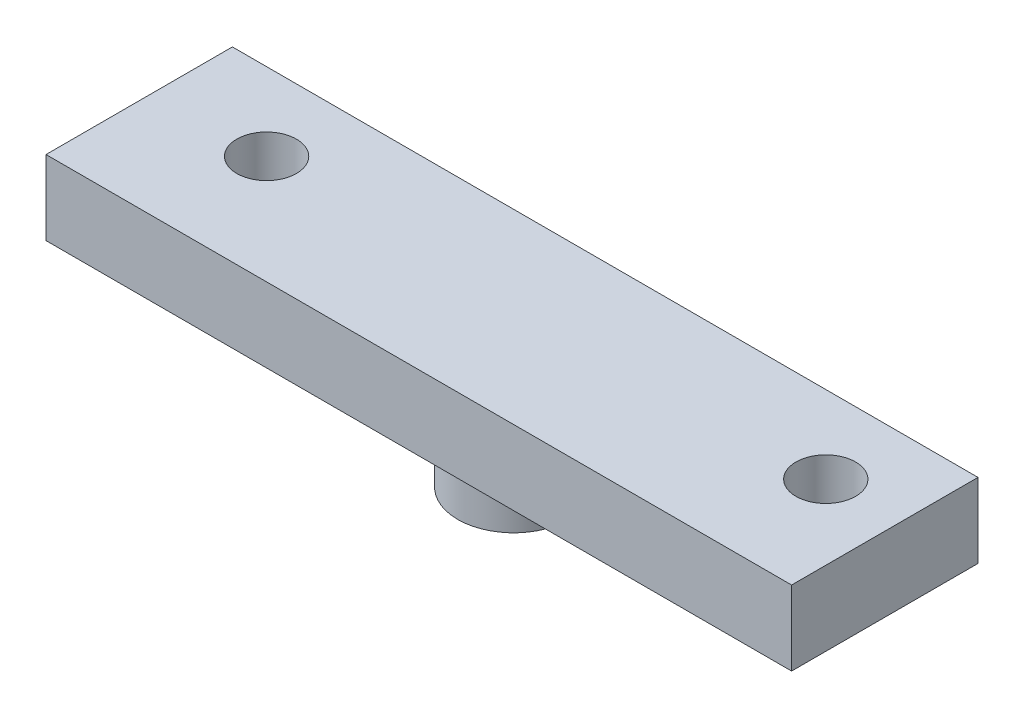
ISO-10303-21;
HEADER;
FILE_DESCRIPTION(('STEP AP214'),'2;1');
FILE_NAME('part.step','',(''),(''),'','','');
FILE_SCHEMA(('AUTOMOTIVE_DESIGN { 1 0 10303 214 1 1 1 1 }'));
ENDSEC;
DATA;
#1=APPLICATION_CONTEXT('core data for automotive mechanical design processes');
#2=APPLICATION_PROTOCOL_DEFINITION('international standard','automotive_design',2000,#1);
#3=PRODUCT_CONTEXT('',#1,'mechanical');
#4=PRODUCT('Part','Part','',(#3));
#5=PRODUCT_RELATED_PRODUCT_CATEGORY('part','',(#4));
#6=PRODUCT_DEFINITION_FORMATION('','',#4);
#7=PRODUCT_DEFINITION_CONTEXT('part definition',#1,'design');
#8=PRODUCT_DEFINITION('design','',#6,#7);
#9=PRODUCT_DEFINITION_SHAPE('','',#8);
#10=(LENGTH_UNIT() NAMED_UNIT(*) SI_UNIT(.MILLI.,.METRE.));
#11=(NAMED_UNIT(*) PLANE_ANGLE_UNIT() SI_UNIT($,.RADIAN.));
#12=(NAMED_UNIT(*) SI_UNIT($,.STERADIAN.) SOLID_ANGLE_UNIT());
#13=UNCERTAINTY_MEASURE_WITH_UNIT(LENGTH_MEASURE(1.E-05),#10,'distance_accuracy_value','');
#14=(GEOMETRIC_REPRESENTATION_CONTEXT(3) GLOBAL_UNCERTAINTY_ASSIGNED_CONTEXT((#13)) GLOBAL_UNIT_ASSIGNED_CONTEXT((#10,
#11,#12)) REPRESENTATION_CONTEXT('',''));
#15=CARTESIAN_POINT('',(0.,0.,0.));
#16=DIRECTION('',(0.,0.,1.));
#17=DIRECTION('',(1.,0.,0.));
#18=AXIS2_PLACEMENT_3D('',#15,#16,#17);
#19=CARTESIAN_POINT('',(0.,2.,0.));
#20=DIRECTION('',(0.,1.,0.));
#21=DIRECTION('',(0.,0.,1.));
#22=AXIS2_PLACEMENT_3D('',#19,#20,#21);
#23=PLANE('',#22);
#24=CARTESIAN_POINT('',(2.67762937928907,2.,-1.37738689699063));
#25=DIRECTION('',(0.,1.,0.));
#26=DIRECTION('',(0.,0.,1.));
#27=AXIS2_PLACEMENT_3D('',#24,#25,#26);
#28=CIRCLE('',#27,0.800000000000001);
#29=CARTESIAN_POINT('',(2.67762937928907,2.,-0.577386896990629));
#30=VERTEX_POINT('',#29);
#31=EDGE_CURVE('E132',#30,#30,#28,.T.);
#32=ORIENTED_EDGE('',*,*,#31,.F.);
#33=EDGE_LOOP('',(#32));
#34=FACE_BOUND('',#33,.T.);
#35=DIRECTION('',(0.,0.,1.));
#36=VECTOR('',#35,1.);
#37=CARTESIAN_POINT('',(-0.322370620710929,2.,-3.46002477727242));
#38=LINE('',#37,#36);
#39=CARTESIAN_POINT('',(-0.322370620710929,2.,-3.46002477727242));
#40=VERTEX_POINT('',#39);
#41=CARTESIAN_POINT('',(-0.322370620710929,2.,1.53997522272758));
#42=VERTEX_POINT('',#41);
#43=EDGE_CURVE('E114',#40,#42,#38,.T.);
#44=ORIENTED_EDGE('',*,*,#43,.T.);
#45=DIRECTION('',(1.,0.,0.));
#46=VECTOR('',#45,1.);
#47=CARTESIAN_POINT('',(-0.322370620710929,2.,1.53997522272758));
#48=LINE('',#47,#46);
#49=CARTESIAN_POINT('',(19.6776293792891,2.,1.53997522272758));
#50=VERTEX_POINT('',#49);
#51=EDGE_CURVE('E106',#42,#50,#48,.T.);
#52=ORIENTED_EDGE('',*,*,#51,.T.);
#53=DIRECTION('',(0.,0.,1.));
#54=VECTOR('',#53,1.);
#55=CARTESIAN_POINT('',(19.6776293792891,2.,-3.46002477727242));
#56=LINE('',#55,#54);
#57=CARTESIAN_POINT('',(19.6776293792891,2.,-3.46002477727242));
#58=VERTEX_POINT('',#57);
#59=EDGE_CURVE('E113',#58,#50,#56,.T.);
#60=ORIENTED_EDGE('',*,*,#59,.F.);
#61=DIRECTION('',(1.,0.,0.));
#62=VECTOR('',#61,1.);
#63=CARTESIAN_POINT('',(-0.322370620710929,2.,-3.46002477727242));
#64=LINE('',#63,#62);
#65=EDGE_CURVE('E125',#40,#58,#64,.T.);
#66=ORIENTED_EDGE('',*,*,#65,.F.);
#67=EDGE_LOOP('',(#44,#52,#60,#66));
#68=FACE_BOUND('',#67,.T.);
#69=CARTESIAN_POINT('',(17.6776293792891,2.,-1.37738689699063));
#70=DIRECTION('',(0.,1.,0.));
#71=DIRECTION('',(0.,0.,1.));
#72=AXIS2_PLACEMENT_3D('',#69,#70,#71);
#73=CIRCLE('',#72,0.799999999999999);
#74=CARTESIAN_POINT('',(17.6776293792891,2.,-0.57738689699063));
#75=VERTEX_POINT('',#74);
#76=EDGE_CURVE('E183',#75,#75,#73,.T.);
#77=ORIENTED_EDGE('',*,*,#76,.F.);
#78=EDGE_LOOP('',(#77));
#79=FACE_BOUND('',#78,.T.);
#80=ADVANCED_FACE('F63',(#34,#68,#79),#23,.T.);
#81=CARTESIAN_POINT('',(0.,0.,0.));
#82=DIRECTION('',(0.,1.,0.));
#83=DIRECTION('',(0.,0.,1.));
#84=AXIS2_PLACEMENT_3D('',#81,#82,#83);
#85=PLANE('',#84);
#86=CARTESIAN_POINT('',(9.67762937928907,0.,-1.00404984938507));
#87=DIRECTION('',(0.,1.,0.));
#88=DIRECTION('',(0.,0.,1.));
#89=AXIS2_PLACEMENT_3D('',#86,#87,#88);
#90=CIRCLE('',#89,1.5);
#91=CARTESIAN_POINT('',(9.67762937928907,0.,0.49595015061493));
#92=VERTEX_POINT('',#91);
#93=EDGE_CURVE('E12',#92,#92,#90,.F.);
#94=ORIENTED_EDGE('',*,*,#93,.F.);
#95=EDGE_LOOP('',(#94));
#96=FACE_BOUND('',#95,.T.);
#97=DIRECTION('',(0.,0.,1.));
#98=VECTOR('',#97,1.);
#99=CARTESIAN_POINT('',(-0.322370620710929,0.,-3.46002477727242));
#100=LINE('',#99,#98);
#101=CARTESIAN_POINT('',(-0.322370620710929,0.,-3.46002477727242));
#102=VERTEX_POINT('',#101);
#103=CARTESIAN_POINT('',(-0.322370620710929,0.,1.53997522272758));
#104=VERTEX_POINT('',#103);
#105=EDGE_CURVE('E130',#102,#104,#100,.T.);
#106=ORIENTED_EDGE('',*,*,#105,.F.);
#107=DIRECTION('',(1.,0.,0.));
#108=VECTOR('',#107,1.);
#109=CARTESIAN_POINT('',(-0.322370620710929,0.,-3.46002477727242));
#110=LINE('',#109,#108);
#111=CARTESIAN_POINT('',(19.6776293792891,0.,-3.46002477727242));
#112=VERTEX_POINT('',#111);
#113=EDGE_CURVE('E136',#102,#112,#110,.T.);
#114=ORIENTED_EDGE('',*,*,#113,.T.);
#115=DIRECTION('',(0.,0.,1.));
#116=VECTOR('',#115,1.);
#117=CARTESIAN_POINT('',(19.6776293792891,0.,-3.46002477727242));
#118=LINE('',#117,#116);
#119=CARTESIAN_POINT('',(19.6776293792891,0.,1.53997522272758));
#120=VERTEX_POINT('',#119);
#121=EDGE_CURVE('E134',#112,#120,#118,.T.);
#122=ORIENTED_EDGE('',*,*,#121,.T.);
#123=DIRECTION('',(1.,0.,0.));
#124=VECTOR('',#123,1.);
#125=CARTESIAN_POINT('',(-0.322370620710929,0.,1.53997522272758));
#126=LINE('',#125,#124);
#127=EDGE_CURVE('E120',#104,#120,#126,.T.);
#128=ORIENTED_EDGE('',*,*,#127,.F.);
#129=EDGE_LOOP('',(#106,#114,#122,#128));
#130=FACE_BOUND('',#129,.T.);
#131=CARTESIAN_POINT('',(2.67762937928907,0.,-1.37738689699063));
#132=DIRECTION('',(0.,1.,0.));
#133=DIRECTION('',(0.,0.,1.));
#134=AXIS2_PLACEMENT_3D('',#131,#132,#133);
#135=CIRCLE('',#134,0.800000000000001);
#136=CARTESIAN_POINT('',(2.67762937928907,0.,-0.577386896990629));
#137=VERTEX_POINT('',#136);
#138=EDGE_CURVE('E187',#137,#137,#135,.T.);
#139=ORIENTED_EDGE('',*,*,#138,.T.);
#140=EDGE_LOOP('',(#139));
#141=FACE_BOUND('',#140,.T.);
#142=CARTESIAN_POINT('',(17.6776293792891,0.,-1.37738689699063));
#143=DIRECTION('',(0.,1.,0.));
#144=DIRECTION('',(0.,0.,1.));
#145=AXIS2_PLACEMENT_3D('',#142,#143,#144);
#146=CIRCLE('',#145,0.799999999999999);
#147=CARTESIAN_POINT('',(17.6776293792891,0.,-0.57738689699063));
#148=VERTEX_POINT('',#147);
#149=EDGE_CURVE('E180',#148,#148,#146,.T.);
#150=ORIENTED_EDGE('',*,*,#149,.T.);
#151=EDGE_LOOP('',(#150));
#152=FACE_BOUND('',#151,.T.);
#153=ADVANCED_FACE('F141',(#96,#130,#141,#152),#85,.F.);
#154=CARTESIAN_POINT('',(-0.322370620710929,2.,-3.46002477727242));
#155=DIRECTION('',(1.,0.,0.));
#156=DIRECTION('',(0.,0.,-1.));
#157=AXIS2_PLACEMENT_3D('',#154,#155,#156);
#158=PLANE('',#157);
#159=ORIENTED_EDGE('',*,*,#105,.T.);
#160=DIRECTION('',(0.,-1.,0.));
#161=VECTOR('',#160,1.);
#162=CARTESIAN_POINT('',(-0.322370620710929,2.,1.53997522272758));
#163=LINE('',#162,#161);
#164=EDGE_CURVE('E72',#42,#104,#163,.T.);
#165=ORIENTED_EDGE('',*,*,#164,.F.);
#166=ORIENTED_EDGE('',*,*,#43,.F.);
#167=DIRECTION('',(0.,-1.,0.));
#168=VECTOR('',#167,1.);
#169=CARTESIAN_POINT('',(-0.322370620710929,2.,-3.46002477727242));
#170=LINE('',#169,#168);
#171=EDGE_CURVE('E80',#40,#102,#170,.T.);
#172=ORIENTED_EDGE('',*,*,#171,.T.);
#173=EDGE_LOOP('',(#159,#165,#166,#172));
#174=FACE_BOUND('',#173,.T.);
#175=ADVANCED_FACE('F65',(#174),#158,.F.);
#176=CARTESIAN_POINT('',(-0.322370620710929,2.,1.53997522272758));
#177=DIRECTION('',(0.,0.,-1.));
#178=DIRECTION('',(-1.,0.,0.));
#179=AXIS2_PLACEMENT_3D('',#176,#177,#178);
#180=PLANE('',#179);
#181=ORIENTED_EDGE('',*,*,#127,.T.);
#182=DIRECTION('',(0.,-1.,0.));
#183=VECTOR('',#182,1.);
#184=CARTESIAN_POINT('',(19.6776293792891,2.,1.53997522272758));
#185=LINE('',#184,#183);
#186=EDGE_CURVE('E118',#50,#120,#185,.T.);
#187=ORIENTED_EDGE('',*,*,#186,.F.);
#188=ORIENTED_EDGE('',*,*,#51,.F.);
#189=ORIENTED_EDGE('',*,*,#164,.T.);
#190=EDGE_LOOP('',(#181,#187,#188,#189));
#191=FACE_BOUND('',#190,.T.);
#192=ADVANCED_FACE('F119',(#191),#180,.F.);
#193=CARTESIAN_POINT('',(19.6776293792891,2.,-3.46002477727242));
#194=DIRECTION('',(1.,0.,0.));
#195=DIRECTION('',(0.,0.,-1.));
#196=AXIS2_PLACEMENT_3D('',#193,#194,#195);
#197=PLANE('',#196);
#198=ORIENTED_EDGE('',*,*,#121,.F.);
#199=DIRECTION('',(0.,-1.,0.));
#200=VECTOR('',#199,1.);
#201=CARTESIAN_POINT('',(19.6776293792891,2.,-3.46002477727242));
#202=LINE('',#201,#200);
#203=EDGE_CURVE('E94',#58,#112,#202,.T.);
#204=ORIENTED_EDGE('',*,*,#203,.F.);
#205=ORIENTED_EDGE('',*,*,#59,.T.);
#206=ORIENTED_EDGE('',*,*,#186,.T.);
#207=EDGE_LOOP('',(#198,#204,#205,#206));
#208=FACE_BOUND('',#207,.T.);
#209=ADVANCED_FACE('F124',(#208),#197,.T.);
#210=CARTESIAN_POINT('',(-0.322370620710929,2.,-3.46002477727242));
#211=DIRECTION('',(0.,0.,-1.));
#212=DIRECTION('',(-1.,0.,0.));
#213=AXIS2_PLACEMENT_3D('',#210,#211,#212);
#214=PLANE('',#213);
#215=ORIENTED_EDGE('',*,*,#113,.F.);
#216=ORIENTED_EDGE('',*,*,#171,.F.);
#217=ORIENTED_EDGE('',*,*,#65,.T.);
#218=ORIENTED_EDGE('',*,*,#203,.T.);
#219=EDGE_LOOP('',(#215,#216,#217,#218));
#220=FACE_BOUND('',#219,.T.);
#221=ADVANCED_FACE('F143',(#220),#214,.T.);
#222=CARTESIAN_POINT('',(2.67762937928907,2.,-1.37738689699063));
#223=DIRECTION('',(0.,-1.,0.));
#224=DIRECTION('',(0.,0.,-1.));
#225=AXIS2_PLACEMENT_3D('',#222,#223,#224);
#226=CYLINDRICAL_SURFACE('',#225,0.800000000000001);
#227=ORIENTED_EDGE('',*,*,#31,.T.);
#228=EDGE_LOOP('',(#227));
#229=FACE_BOUND('',#228,.T.);
#230=ORIENTED_EDGE('',*,*,#138,.F.);
#231=EDGE_LOOP('',(#230));
#232=FACE_BOUND('',#231,.T.);
#233=ADVANCED_FACE('F145',(#229,#232),#226,.F.);
#234=CARTESIAN_POINT('',(17.6776293792891,2.,-1.37738689699063));
#235=DIRECTION('',(0.,-1.,0.));
#236=DIRECTION('',(0.,0.,-1.));
#237=AXIS2_PLACEMENT_3D('',#234,#235,#236);
#238=CYLINDRICAL_SURFACE('',#237,0.799999999999999);
#239=ORIENTED_EDGE('',*,*,#76,.T.);
#240=EDGE_LOOP('',(#239));
#241=FACE_BOUND('',#240,.T.);
#242=ORIENTED_EDGE('',*,*,#149,.F.);
#243=EDGE_LOOP('',(#242));
#244=FACE_BOUND('',#243,.T.);
#245=ADVANCED_FACE('F151',(#241,#244),#238,.F.);
#246=CARTESIAN_POINT('',(9.67762937928907,-2.,-1.00404984938507));
#247=DIRECTION('',(0.,1.,0.));
#248=DIRECTION('',(0.,0.,1.));
#249=AXIS2_PLACEMENT_3D('',#246,#247,#248);
#250=CYLINDRICAL_SURFACE('',#249,1.5);
#251=CARTESIAN_POINT('',(9.67762937928907,-2.,-1.00404984938507));
#252=DIRECTION('',(0.,-1.,0.));
#253=DIRECTION('',(0.,0.,-1.));
#254=AXIS2_PLACEMENT_3D('',#251,#252,#253);
#255=CIRCLE('',#254,1.5);
#256=CARTESIAN_POINT('',(9.67762937928907,-2.,-2.50404984938507));
#257=VERTEX_POINT('',#256);
#258=EDGE_CURVE('E179',#257,#257,#255,.T.);
#259=ORIENTED_EDGE('',*,*,#258,.F.);
#260=EDGE_LOOP('',(#259));
#261=FACE_BOUND('',#260,.T.);
#262=ORIENTED_EDGE('',*,*,#93,.T.);
#263=EDGE_LOOP('',(#262));
#264=FACE_BOUND('',#263,.T.);
#265=ADVANCED_FACE('F167',(#261,#264),#250,.T.);
#266=CARTESIAN_POINT('',(9.67762937928907,-2.,-1.00404984938507));
#267=DIRECTION('',(0.,-1.,0.));
#268=DIRECTION('',(0.,0.,-1.));
#269=AXIS2_PLACEMENT_3D('',#266,#267,#268);
#270=PLANE('',#269);
#271=ORIENTED_EDGE('',*,*,#258,.T.);
#272=EDGE_LOOP('',(#271));
#273=FACE_BOUND('',#272,.T.);
#274=ADVANCED_FACE('F171',(#273),#270,.T.);
#275=CLOSED_SHELL('',(#80,#153,#175,#192,#209,#221,#233,#245,#265,#274));
#276=MANIFOLD_SOLID_BREP('B2',#275);
#277=ADVANCED_BREP_SHAPE_REPRESENTATION('',(#18,#276),#14);
#278=SHAPE_DEFINITION_REPRESENTATION(#9,#277);
ENDSEC;
END-ISO-10303-21;
